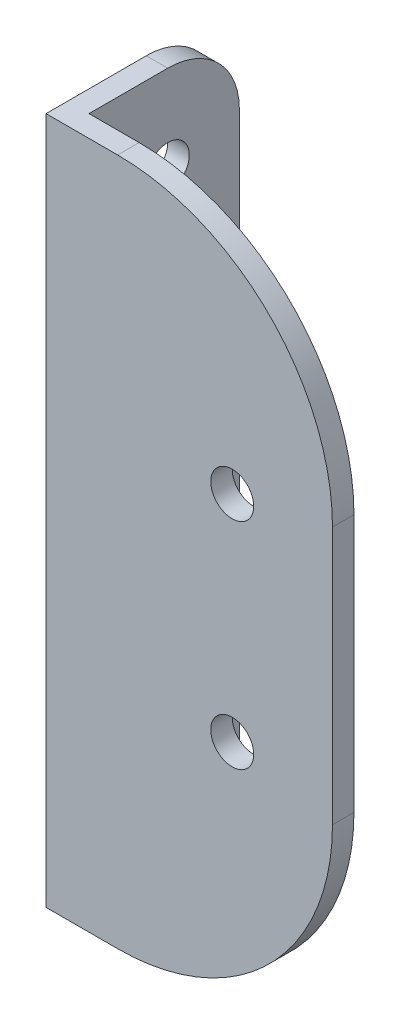
ISO-10303-21;
HEADER;
FILE_DESCRIPTION(('STEP AP214'),'2;1');
FILE_NAME('part.step','',(''),(''),'','','');
FILE_SCHEMA(('AUTOMOTIVE_DESIGN { 1 0 10303 214 1 1 1 1 }'));
ENDSEC;
DATA;
#1=APPLICATION_CONTEXT('core data for automotive mechanical design processes');
#2=APPLICATION_PROTOCOL_DEFINITION('international standard','automotive_design',2000,#1);
#3=PRODUCT_CONTEXT('',#1,'mechanical');
#4=PRODUCT('Part','Part','',(#3));
#5=PRODUCT_RELATED_PRODUCT_CATEGORY('part','',(#4));
#6=PRODUCT_DEFINITION_FORMATION('','',#4);
#7=PRODUCT_DEFINITION_CONTEXT('part definition',#1,'design');
#8=PRODUCT_DEFINITION('design','',#6,#7);
#9=PRODUCT_DEFINITION_SHAPE('','',#8);
#10=(LENGTH_UNIT() NAMED_UNIT(*) SI_UNIT(.MILLI.,.METRE.));
#11=(NAMED_UNIT(*) PLANE_ANGLE_UNIT() SI_UNIT($,.RADIAN.));
#12=(NAMED_UNIT(*) SI_UNIT($,.STERADIAN.) SOLID_ANGLE_UNIT());
#13=UNCERTAINTY_MEASURE_WITH_UNIT(LENGTH_MEASURE(1.E-05),#10,'distance_accuracy_value','');
#14=(GEOMETRIC_REPRESENTATION_CONTEXT(3) GLOBAL_UNCERTAINTY_ASSIGNED_CONTEXT((#13)) GLOBAL_UNIT_ASSIGNED_CONTEXT((#10,
#11,#12)) REPRESENTATION_CONTEXT('',''));
#15=CARTESIAN_POINT('',(0.,0.,0.));
#16=DIRECTION('',(0.,0.,1.));
#17=DIRECTION('',(1.,0.,0.));
#18=AXIS2_PLACEMENT_3D('',#15,#16,#17);
#19=CARTESIAN_POINT('',(0.,48.,0.));
#20=DIRECTION('',(0.,0.,-1.));
#21=DIRECTION('',(-1.,0.,0.));
#22=AXIS2_PLACEMENT_3D('',#19,#20,#21);
#23=PLANE('',#22);
#24=CARTESIAN_POINT('',(13.,16.5,0.));
#25=DIRECTION('',(0.,0.,1.));
#26=DIRECTION('',(1.,0.,0.));
#27=AXIS2_PLACEMENT_3D('',#24,#25,#26);
#28=CIRCLE('',#27,1.5);
#29=CARTESIAN_POINT('',(14.5,16.5,0.));
#30=VERTEX_POINT('',#29);
#31=EDGE_CURVE('E173',#30,#30,#28,.T.);
#32=ORIENTED_EDGE('',*,*,#31,.F.);
#33=EDGE_LOOP('',(#32));
#34=FACE_BOUND('',#33,.T.);
#35=CARTESIAN_POINT('',(13.,31.5,0.));
#36=DIRECTION('',(0.,0.,1.));
#37=DIRECTION('',(1.,0.,0.));
#38=AXIS2_PLACEMENT_3D('',#35,#36,#37);
#39=CIRCLE('',#38,1.5);
#40=CARTESIAN_POINT('',(14.5,31.5,0.));
#41=VERTEX_POINT('',#40);
#42=EDGE_CURVE('E169',#41,#41,#39,.T.);
#43=ORIENTED_EDGE('',*,*,#42,.F.);
#44=EDGE_LOOP('',(#43));
#45=FACE_BOUND('',#44,.T.);
#46=DIRECTION('',(1.,0.,0.));
#47=VECTOR('',#46,1.);
#48=CARTESIAN_POINT('',(0.,0.,0.));
#49=LINE('',#48,#47);
#50=CARTESIAN_POINT('',(0.,0.,0.));
#51=VERTEX_POINT('',#50);
#52=CARTESIAN_POINT('',(5.,0.,0.));
#53=VERTEX_POINT('',#52);
#54=EDGE_CURVE('E147',#51,#53,#49,.T.);
#55=ORIENTED_EDGE('',*,*,#54,.T.);
#56=CARTESIAN_POINT('',(5.,15.,0.));
#57=DIRECTION('',(0.,0.,-1.));
#58=DIRECTION('',(-1.,0.,0.));
#59=AXIS2_PLACEMENT_3D('',#56,#57,#58);
#60=CIRCLE('',#59,15.);
#61=CARTESIAN_POINT('',(20.,15.,0.));
#62=VERTEX_POINT('',#61);
#63=EDGE_CURVE('E42',#53,#62,#60,.F.);
#64=ORIENTED_EDGE('',*,*,#63,.T.);
#65=DIRECTION('',(0.,-1.,0.));
#66=VECTOR('',#65,1.);
#67=CARTESIAN_POINT('',(20.,48.,0.));
#68=LINE('',#67,#66);
#69=CARTESIAN_POINT('',(20.,33.,0.));
#70=VERTEX_POINT('',#69);
#71=EDGE_CURVE('E163',#70,#62,#68,.T.);
#72=ORIENTED_EDGE('',*,*,#71,.F.);
#73=CARTESIAN_POINT('',(5.,33.,0.));
#74=DIRECTION('',(0.,0.,-1.));
#75=DIRECTION('',(-1.,0.,0.));
#76=AXIS2_PLACEMENT_3D('',#73,#74,#75);
#77=CIRCLE('',#76,15.);
#78=CARTESIAN_POINT('',(5.,48.,0.));
#79=VERTEX_POINT('',#78);
#80=EDGE_CURVE('E49',#70,#79,#77,.F.);
#81=ORIENTED_EDGE('',*,*,#80,.T.);
#82=DIRECTION('',(1.,0.,0.));
#83=VECTOR('',#82,1.);
#84=CARTESIAN_POINT('',(0.,48.,0.));
#85=LINE('',#84,#83);
#86=CARTESIAN_POINT('',(0.,48.,0.));
#87=VERTEX_POINT('',#86);
#88=EDGE_CURVE('E124',#87,#79,#85,.T.);
#89=ORIENTED_EDGE('',*,*,#88,.F.);
#90=DIRECTION('',(0.,-1.,0.));
#91=VECTOR('',#90,1.);
#92=CARTESIAN_POINT('',(0.,48.,0.));
#93=LINE('',#92,#91);
#94=EDGE_CURVE('E143',#87,#51,#93,.T.);
#95=ORIENTED_EDGE('',*,*,#94,.T.);
#96=EDGE_LOOP('',(#55,#64,#72,#81,#89,#95));
#97=FACE_BOUND('',#96,.T.);
#98=ADVANCED_FACE('F34',(#34,#45,#97),#23,.F.);
#99=CARTESIAN_POINT('',(20.,48.,-1.5));
#100=DIRECTION('',(-1.,0.,0.));
#101=DIRECTION('',(0.,0.,1.));
#102=AXIS2_PLACEMENT_3D('',#99,#100,#101);
#103=PLANE('',#102);
#104=ORIENTED_EDGE('',*,*,#71,.T.);
#105=DIRECTION('',(0.,0.,-1.));
#106=VECTOR('',#105,1.);
#107=CARTESIAN_POINT('',(20.,15.,-1.5));
#108=LINE('',#107,#106);
#109=CARTESIAN_POINT('',(20.,15.,-1.5));
#110=VERTEX_POINT('',#109);
#111=EDGE_CURVE('E191',#62,#110,#108,.T.);
#112=ORIENTED_EDGE('',*,*,#111,.T.);
#113=DIRECTION('',(0.,-1.,0.));
#114=VECTOR('',#113,1.);
#115=CARTESIAN_POINT('',(20.,48.,-1.5));
#116=LINE('',#115,#114);
#117=CARTESIAN_POINT('',(20.,33.,-1.5));
#118=VERTEX_POINT('',#117);
#119=EDGE_CURVE('E134',#118,#110,#116,.T.);
#120=ORIENTED_EDGE('',*,*,#119,.F.);
#121=DIRECTION('',(0.,0.,-1.));
#122=VECTOR('',#121,1.);
#123=CARTESIAN_POINT('',(20.,33.,-1.5));
#124=LINE('',#123,#122);
#125=EDGE_CURVE('E189',#118,#70,#124,.F.);
#126=ORIENTED_EDGE('',*,*,#125,.T.);
#127=EDGE_LOOP('',(#104,#112,#120,#126));
#128=FACE_BOUND('',#127,.T.);
#129=ADVANCED_FACE('F203',(#128),#103,.F.);
#130=CARTESIAN_POINT('',(1.5,48.,-1.5));
#131=DIRECTION('',(0.,0.,1.));
#132=DIRECTION('',(1.,0.,0.));
#133=AXIS2_PLACEMENT_3D('',#130,#131,#132);
#134=PLANE('',#133);
#135=CARTESIAN_POINT('',(13.,16.5,-1.5));
#136=DIRECTION('',(0.,0.,1.));
#137=DIRECTION('',(1.,0.,0.));
#138=AXIS2_PLACEMENT_3D('',#135,#136,#137);
#139=CIRCLE('',#138,1.5);
#140=CARTESIAN_POINT('',(14.5,16.5,-1.5));
#141=VERTEX_POINT('',#140);
#142=EDGE_CURVE('E170',#141,#141,#139,.T.);
#143=ORIENTED_EDGE('',*,*,#142,.T.);
#144=EDGE_LOOP('',(#143));
#145=FACE_BOUND('',#144,.T.);
#146=CARTESIAN_POINT('',(13.,31.5,-1.5));
#147=DIRECTION('',(0.,0.,1.));
#148=DIRECTION('',(1.,0.,0.));
#149=AXIS2_PLACEMENT_3D('',#146,#147,#148);
#150=CIRCLE('',#149,1.5);
#151=CARTESIAN_POINT('',(14.5,31.5,-1.5));
#152=VERTEX_POINT('',#151);
#153=EDGE_CURVE('E149',#152,#152,#150,.T.);
#154=ORIENTED_EDGE('',*,*,#153,.T.);
#155=EDGE_LOOP('',(#154));
#156=FACE_BOUND('',#155,.T.);
#157=ORIENTED_EDGE('',*,*,#119,.T.);
#158=CARTESIAN_POINT('',(5.,15.,-1.5));
#159=DIRECTION('',(0.,0.,1.));
#160=DIRECTION('',(1.,0.,0.));
#161=AXIS2_PLACEMENT_3D('',#158,#159,#160);
#162=CIRCLE('',#161,15.);
#163=CARTESIAN_POINT('',(5.,0.,-1.5));
#164=VERTEX_POINT('',#163);
#165=EDGE_CURVE('E196',#110,#164,#162,.F.);
#166=ORIENTED_EDGE('',*,*,#165,.T.);
#167=DIRECTION('',(-1.,0.,0.));
#168=VECTOR('',#167,1.);
#169=CARTESIAN_POINT('',(1.5,0.,-1.5));
#170=LINE('',#169,#168);
#171=CARTESIAN_POINT('',(1.5,0.,-1.5));
#172=VERTEX_POINT('',#171);
#173=EDGE_CURVE('E130',#164,#172,#170,.T.);
#174=ORIENTED_EDGE('',*,*,#173,.T.);
#175=DIRECTION('',(0.,-1.,0.));
#176=VECTOR('',#175,1.);
#177=CARTESIAN_POINT('',(1.5,48.,-1.5));
#178=LINE('',#177,#176);
#179=CARTESIAN_POINT('',(1.5,48.,-1.5));
#180=VERTEX_POINT('',#179);
#181=EDGE_CURVE('E127',#180,#172,#178,.T.);
#182=ORIENTED_EDGE('',*,*,#181,.F.);
#183=DIRECTION('',(-1.,0.,0.));
#184=VECTOR('',#183,1.);
#185=CARTESIAN_POINT('',(1.5,48.,-1.5));
#186=LINE('',#185,#184);
#187=CARTESIAN_POINT('',(5.,48.,-1.5));
#188=VERTEX_POINT('',#187);
#189=EDGE_CURVE('E115',#188,#180,#186,.T.);
#190=ORIENTED_EDGE('',*,*,#189,.F.);
#191=CARTESIAN_POINT('',(5.,33.,-1.5));
#192=DIRECTION('',(0.,0.,1.));
#193=DIRECTION('',(1.,0.,0.));
#194=AXIS2_PLACEMENT_3D('',#191,#192,#193);
#195=CIRCLE('',#194,15.);
#196=EDGE_CURVE('E194',#188,#118,#195,.F.);
#197=ORIENTED_EDGE('',*,*,#196,.T.);
#198=EDGE_LOOP('',(#157,#166,#174,#182,#190,#197));
#199=FACE_BOUND('',#198,.T.);
#200=ADVANCED_FACE('F129',(#145,#156,#199),#134,.F.);
#201=CARTESIAN_POINT('',(1.5,48.,-12.));
#202=DIRECTION('',(-1.,0.,0.));
#203=DIRECTION('',(0.,0.,1.));
#204=AXIS2_PLACEMENT_3D('',#201,#202,#203);
#205=PLANE('',#204);
#206=CARTESIAN_POINT('',(1.5,24.,-7.));
#207=DIRECTION('',(-1.,0.,0.));
#208=DIRECTION('',(0.,0.,1.));
#209=AXIS2_PLACEMENT_3D('',#206,#207,#208);
#210=CIRCLE('',#209,3.);
#211=CARTESIAN_POINT('',(1.5,24.,-4.));
#212=VERTEX_POINT('',#211);
#213=EDGE_CURVE('E235',#212,#212,#210,.F.);
#214=ORIENTED_EDGE('',*,*,#213,.F.);
#215=EDGE_LOOP('',(#214));
#216=FACE_BOUND('',#215,.T.);
#217=CARTESIAN_POINT('',(1.5,6.00000000000001,-7.00000000000001));
#218=DIRECTION('',(-1.,0.,0.));
#219=DIRECTION('',(0.,0.,1.));
#220=AXIS2_PLACEMENT_3D('',#217,#218,#219);
#221=CIRCLE('',#220,1.5);
#222=CARTESIAN_POINT('',(1.5,6.00000000000001,-5.50000000000001));
#223=VERTEX_POINT('',#222);
#224=EDGE_CURVE('E238',#223,#223,#221,.F.);
#225=ORIENTED_EDGE('',*,*,#224,.F.);
#226=EDGE_LOOP('',(#225));
#227=FACE_BOUND('',#226,.T.);
#228=CARTESIAN_POINT('',(1.5,42.,-7.));
#229=DIRECTION('',(-1.,0.,0.));
#230=DIRECTION('',(0.,0.,1.));
#231=AXIS2_PLACEMENT_3D('',#228,#229,#230);
#232=CIRCLE('',#231,1.5);
#233=CARTESIAN_POINT('',(1.5,42.,-5.5));
#234=VERTEX_POINT('',#233);
#235=EDGE_CURVE('E229',#234,#234,#232,.F.);
#236=ORIENTED_EDGE('',*,*,#235,.F.);
#237=EDGE_LOOP('',(#236));
#238=FACE_BOUND('',#237,.T.);
#239=DIRECTION('',(0.,0.,-1.));
#240=VECTOR('',#239,1.);
#241=CARTESIAN_POINT('',(1.5,0.,-12.));
#242=LINE('',#241,#240);
#243=CARTESIAN_POINT('',(1.5,0.,-7.));
#244=VERTEX_POINT('',#243);
#245=EDGE_CURVE('E151',#172,#244,#242,.T.);
#246=ORIENTED_EDGE('',*,*,#245,.T.);
#247=CARTESIAN_POINT('',(1.5,5.,-7.));
#248=DIRECTION('',(-1.,0.,0.));
#249=DIRECTION('',(0.,0.,1.));
#250=AXIS2_PLACEMENT_3D('',#247,#248,#249);
#251=CIRCLE('',#250,5.);
#252=CARTESIAN_POINT('',(1.5,5.,-12.));
#253=VERTEX_POINT('',#252);
#254=EDGE_CURVE('E185',#244,#253,#251,.F.);
#255=ORIENTED_EDGE('',*,*,#254,.T.);
#256=DIRECTION('',(0.,-1.,0.));
#257=VECTOR('',#256,1.);
#258=CARTESIAN_POINT('',(1.5,48.,-12.));
#259=LINE('',#258,#257);
#260=CARTESIAN_POINT('',(1.5,43.,-12.));
#261=VERTEX_POINT('',#260);
#262=EDGE_CURVE('E135',#261,#253,#259,.T.);
#263=ORIENTED_EDGE('',*,*,#262,.F.);
#264=CARTESIAN_POINT('',(1.5,43.,-7.));
#265=DIRECTION('',(-1.,0.,0.));
#266=DIRECTION('',(0.,0.,1.));
#267=AXIS2_PLACEMENT_3D('',#264,#265,#266);
#268=CIRCLE('',#267,5.);
#269=CARTESIAN_POINT('',(1.5,48.,-7.));
#270=VERTEX_POINT('',#269);
#271=EDGE_CURVE('E140',#261,#270,#268,.F.);
#272=ORIENTED_EDGE('',*,*,#271,.T.);
#273=DIRECTION('',(0.,0.,-1.));
#274=VECTOR('',#273,1.);
#275=CARTESIAN_POINT('',(1.5,48.,-12.));
#276=LINE('',#275,#274);
#277=EDGE_CURVE('E120',#180,#270,#276,.T.);
#278=ORIENTED_EDGE('',*,*,#277,.F.);
#279=ORIENTED_EDGE('',*,*,#181,.T.);
#280=EDGE_LOOP('',(#246,#255,#263,#272,#278,#279));
#281=FACE_BOUND('',#280,.T.);
#282=ADVANCED_FACE('F137',(#216,#227,#238,#281),#205,.F.);
#283=CARTESIAN_POINT('',(0.,48.,-12.));
#284=DIRECTION('',(0.,0.,1.));
#285=DIRECTION('',(1.,0.,0.));
#286=AXIS2_PLACEMENT_3D('',#283,#284,#285);
#287=PLANE('',#286);
#288=ORIENTED_EDGE('',*,*,#262,.T.);
#289=DIRECTION('',(-1.,0.,0.));
#290=VECTOR('',#289,1.);
#291=CARTESIAN_POINT('',(0.,5.,-12.));
#292=LINE('',#291,#290);
#293=CARTESIAN_POINT('',(0.,5.,-12.));
#294=VERTEX_POINT('',#293);
#295=EDGE_CURVE('E175',#253,#294,#292,.T.);
#296=ORIENTED_EDGE('',*,*,#295,.T.);
#297=DIRECTION('',(0.,-1.,0.));
#298=VECTOR('',#297,1.);
#299=CARTESIAN_POINT('',(0.,48.,-12.));
#300=LINE('',#299,#298);
#301=CARTESIAN_POINT('',(0.,43.,-12.));
#302=VERTEX_POINT('',#301);
#303=EDGE_CURVE('E157',#302,#294,#300,.T.);
#304=ORIENTED_EDGE('',*,*,#303,.F.);
#305=DIRECTION('',(-1.,0.,0.));
#306=VECTOR('',#305,1.);
#307=CARTESIAN_POINT('',(0.,43.,-12.));
#308=LINE('',#307,#306);
#309=EDGE_CURVE('E166',#302,#261,#308,.F.);
#310=ORIENTED_EDGE('',*,*,#309,.T.);
#311=EDGE_LOOP('',(#288,#296,#304,#310));
#312=FACE_BOUND('',#311,.T.);
#313=ADVANCED_FACE('F216',(#312),#287,.F.);
#314=CARTESIAN_POINT('',(0.,48.,0.));
#315=DIRECTION('',(1.,0.,0.));
#316=DIRECTION('',(0.,0.,-1.));
#317=AXIS2_PLACEMENT_3D('',#314,#315,#316);
#318=PLANE('',#317);
#319=CARTESIAN_POINT('',(0.,24.,-7.));
#320=DIRECTION('',(1.,0.,0.));
#321=DIRECTION('',(0.,0.,-1.));
#322=AXIS2_PLACEMENT_3D('',#319,#320,#321);
#323=CIRCLE('',#322,3.);
#324=CARTESIAN_POINT('',(0.,24.,-10.));
#325=VERTEX_POINT('',#324);
#326=EDGE_CURVE('E241',#325,#325,#323,.T.);
#327=ORIENTED_EDGE('',*,*,#326,.T.);
#328=EDGE_LOOP('',(#327));
#329=FACE_BOUND('',#328,.T.);
#330=CARTESIAN_POINT('',(0.,6.00000000000001,-7.00000000000001));
#331=DIRECTION('',(1.,0.,0.));
#332=DIRECTION('',(0.,0.,-1.));
#333=AXIS2_PLACEMENT_3D('',#330,#331,#332);
#334=CIRCLE('',#333,1.5);
#335=CARTESIAN_POINT('',(0.,6.00000000000001,-8.5));
#336=VERTEX_POINT('',#335);
#337=EDGE_CURVE('E242',#336,#336,#334,.T.);
#338=ORIENTED_EDGE('',*,*,#337,.T.);
#339=EDGE_LOOP('',(#338));
#340=FACE_BOUND('',#339,.T.);
#341=CARTESIAN_POINT('',(0.,42.,-7.));
#342=DIRECTION('',(1.,0.,0.));
#343=DIRECTION('',(0.,0.,-1.));
#344=AXIS2_PLACEMENT_3D('',#341,#342,#343);
#345=CIRCLE('',#344,1.5);
#346=CARTESIAN_POINT('',(0.,42.,-8.5));
#347=VERTEX_POINT('',#346);
#348=EDGE_CURVE('E232',#347,#347,#345,.T.);
#349=ORIENTED_EDGE('',*,*,#348,.T.);
#350=EDGE_LOOP('',(#349));
#351=FACE_BOUND('',#350,.T.);
#352=ORIENTED_EDGE('',*,*,#303,.T.);
#353=CARTESIAN_POINT('',(0.,5.,-7.));
#354=DIRECTION('',(1.,0.,0.));
#355=DIRECTION('',(0.,0.,-1.));
#356=AXIS2_PLACEMENT_3D('',#353,#354,#355);
#357=CIRCLE('',#356,5.);
#358=CARTESIAN_POINT('',(0.,0.,-7.));
#359=VERTEX_POINT('',#358);
#360=EDGE_CURVE('E180',#294,#359,#357,.F.);
#361=ORIENTED_EDGE('',*,*,#360,.T.);
#362=DIRECTION('',(0.,0.,1.));
#363=VECTOR('',#362,1.);
#364=CARTESIAN_POINT('',(0.,0.,0.));
#365=LINE('',#364,#363);
#366=EDGE_CURVE('E153',#359,#51,#365,.T.);
#367=ORIENTED_EDGE('',*,*,#366,.T.);
#368=ORIENTED_EDGE('',*,*,#94,.F.);
#369=DIRECTION('',(0.,0.,1.));
#370=VECTOR('',#369,1.);
#371=CARTESIAN_POINT('',(0.,48.,0.));
#372=LINE('',#371,#370);
#373=CARTESIAN_POINT('',(0.,48.,-7.));
#374=VERTEX_POINT('',#373);
#375=EDGE_CURVE('E141',#374,#87,#372,.T.);
#376=ORIENTED_EDGE('',*,*,#375,.F.);
#377=CARTESIAN_POINT('',(0.,43.,-7.));
#378=DIRECTION('',(1.,0.,0.));
#379=DIRECTION('',(0.,0.,-1.));
#380=AXIS2_PLACEMENT_3D('',#377,#378,#379);
#381=CIRCLE('',#380,5.);
#382=EDGE_CURVE('E178',#374,#302,#381,.F.);
#383=ORIENTED_EDGE('',*,*,#382,.T.);
#384=EDGE_LOOP('',(#352,#361,#367,#368,#376,#383));
#385=FACE_BOUND('',#384,.T.);
#386=ADVANCED_FACE('F219',(#329,#340,#351,#385),#318,.F.);
#387=CARTESIAN_POINT('',(0.,48.,0.));
#388=DIRECTION('',(0.,-1.,0.));
#389=DIRECTION('',(0.,0.,-1.));
#390=AXIS2_PLACEMENT_3D('',#387,#388,#389);
#391=PLANE('',#390);
#392=ORIENTED_EDGE('',*,*,#88,.T.);
#393=DIRECTION('',(0.,0.,-1.));
#394=VECTOR('',#393,1.);
#395=CARTESIAN_POINT('',(5.,48.,0.));
#396=LINE('',#395,#394);
#397=EDGE_CURVE('E11',#79,#188,#396,.T.);
#398=ORIENTED_EDGE('',*,*,#397,.T.);
#399=ORIENTED_EDGE('',*,*,#189,.T.);
#400=ORIENTED_EDGE('',*,*,#277,.T.);
#401=DIRECTION('',(-1.,0.,0.));
#402=VECTOR('',#401,1.);
#403=CARTESIAN_POINT('',(0.,48.,-7.));
#404=LINE('',#403,#402);
#405=EDGE_CURVE('E187',#270,#374,#404,.T.);
#406=ORIENTED_EDGE('',*,*,#405,.T.);
#407=ORIENTED_EDGE('',*,*,#375,.T.);
#408=EDGE_LOOP('',(#392,#398,#399,#400,#406,#407));
#409=FACE_BOUND('',#408,.T.);
#410=ADVANCED_FACE('F117',(#409),#391,.F.);
#411=CARTESIAN_POINT('',(0.,0.,0.));
#412=DIRECTION('',(0.,-1.,0.));
#413=DIRECTION('',(0.,0.,-1.));
#414=AXIS2_PLACEMENT_3D('',#411,#412,#413);
#415=PLANE('',#414);
#416=ORIENTED_EDGE('',*,*,#173,.F.);
#417=DIRECTION('',(0.,0.,-1.));
#418=VECTOR('',#417,1.);
#419=CARTESIAN_POINT('',(5.,0.,0.));
#420=LINE('',#419,#418);
#421=EDGE_CURVE('E57',#164,#53,#420,.F.);
#422=ORIENTED_EDGE('',*,*,#421,.T.);
#423=ORIENTED_EDGE('',*,*,#54,.F.);
#424=ORIENTED_EDGE('',*,*,#366,.F.);
#425=DIRECTION('',(-1.,0.,0.));
#426=VECTOR('',#425,1.);
#427=CARTESIAN_POINT('',(1.5,0.,-7.));
#428=LINE('',#427,#426);
#429=EDGE_CURVE('E182',#359,#244,#428,.F.);
#430=ORIENTED_EDGE('',*,*,#429,.T.);
#431=ORIENTED_EDGE('',*,*,#245,.F.);
#432=EDGE_LOOP('',(#416,#422,#423,#424,#430,#431));
#433=FACE_BOUND('',#432,.T.);
#434=ADVANCED_FACE('F207',(#433),#415,.T.);
#435=CARTESIAN_POINT('',(13.,31.5,-12.));
#436=DIRECTION('',(0.,0.,1.));
#437=DIRECTION('',(1.,0.,0.));
#438=AXIS2_PLACEMENT_3D('',#435,#436,#437);
#439=CYLINDRICAL_SURFACE('',#438,1.5);
#440=ORIENTED_EDGE('',*,*,#42,.T.);
#441=EDGE_LOOP('',(#440));
#442=FACE_BOUND('',#441,.T.);
#443=ORIENTED_EDGE('',*,*,#153,.F.);
#444=EDGE_LOOP('',(#443));
#445=FACE_BOUND('',#444,.T.);
#446=ADVANCED_FACE('F275',(#442,#445),#439,.F.);
#447=CARTESIAN_POINT('',(13.,16.5,-12.));
#448=DIRECTION('',(0.,0.,1.));
#449=DIRECTION('',(1.,0.,0.));
#450=AXIS2_PLACEMENT_3D('',#447,#448,#449);
#451=CYLINDRICAL_SURFACE('',#450,1.5);
#452=ORIENTED_EDGE('',*,*,#31,.T.);
#453=EDGE_LOOP('',(#452));
#454=FACE_BOUND('',#453,.T.);
#455=ORIENTED_EDGE('',*,*,#142,.F.);
#456=EDGE_LOOP('',(#455));
#457=FACE_BOUND('',#456,.T.);
#458=ADVANCED_FACE('F266',(#454,#457),#451,.F.);
#459=CARTESIAN_POINT('',(20.,42.,-7.));
#460=DIRECTION('',(-1.,0.,0.));
#461=DIRECTION('',(0.,0.,1.));
#462=AXIS2_PLACEMENT_3D('',#459,#460,#461);
#463=CYLINDRICAL_SURFACE('',#462,1.5);
#464=ORIENTED_EDGE('',*,*,#348,.F.);
#465=EDGE_LOOP('',(#464));
#466=FACE_BOUND('',#465,.T.);
#467=ORIENTED_EDGE('',*,*,#235,.T.);
#468=EDGE_LOOP('',(#467));
#469=FACE_BOUND('',#468,.T.);
#470=ADVANCED_FACE('F264',(#466,#469),#463,.F.);
#471=CARTESIAN_POINT('',(20.,6.00000000000001,-7.00000000000001));
#472=DIRECTION('',(-1.,0.,0.));
#473=DIRECTION('',(0.,0.,1.));
#474=AXIS2_PLACEMENT_3D('',#471,#472,#473);
#475=CYLINDRICAL_SURFACE('',#474,1.5);
#476=ORIENTED_EDGE('',*,*,#337,.F.);
#477=EDGE_LOOP('',(#476));
#478=FACE_BOUND('',#477,.T.);
#479=ORIENTED_EDGE('',*,*,#224,.T.);
#480=EDGE_LOOP('',(#479));
#481=FACE_BOUND('',#480,.T.);
#482=ADVANCED_FACE('F253',(#478,#481),#475,.F.);
#483=CARTESIAN_POINT('',(20.,24.,-7.));
#484=DIRECTION('',(-1.,0.,0.));
#485=DIRECTION('',(0.,0.,1.));
#486=AXIS2_PLACEMENT_3D('',#483,#484,#485);
#487=CYLINDRICAL_SURFACE('',#486,3.);
#488=ORIENTED_EDGE('',*,*,#326,.F.);
#489=EDGE_LOOP('',(#488));
#490=FACE_BOUND('',#489,.T.);
#491=ORIENTED_EDGE('',*,*,#213,.T.);
#492=EDGE_LOOP('',(#491));
#493=FACE_BOUND('',#492,.T.);
#494=ADVANCED_FACE('F250',(#490,#493),#487,.F.);
#495=CARTESIAN_POINT('',(0.,5.,-7.));
#496=DIRECTION('',(1.,0.,0.));
#497=DIRECTION('',(0.,0.,-1.));
#498=AXIS2_PLACEMENT_3D('',#495,#496,#497);
#499=CYLINDRICAL_SURFACE('',#498,5.);
#500=ORIENTED_EDGE('',*,*,#254,.F.);
#501=ORIENTED_EDGE('',*,*,#429,.F.);
#502=ORIENTED_EDGE('',*,*,#360,.F.);
#503=ORIENTED_EDGE('',*,*,#295,.F.);
#504=EDGE_LOOP('',(#500,#501,#502,#503));
#505=FACE_BOUND('',#504,.T.);
#506=ADVANCED_FACE('F213',(#505),#499,.T.);
#507=CARTESIAN_POINT('',(0.,43.,-7.));
#508=DIRECTION('',(-1.,0.,0.));
#509=DIRECTION('',(0.,0.,1.));
#510=AXIS2_PLACEMENT_3D('',#507,#508,#509);
#511=CYLINDRICAL_SURFACE('',#510,5.);
#512=ORIENTED_EDGE('',*,*,#271,.F.);
#513=ORIENTED_EDGE('',*,*,#309,.F.);
#514=ORIENTED_EDGE('',*,*,#382,.F.);
#515=ORIENTED_EDGE('',*,*,#405,.F.);
#516=EDGE_LOOP('',(#512,#513,#514,#515));
#517=FACE_BOUND('',#516,.T.);
#518=ADVANCED_FACE('F223',(#517),#511,.T.);
#519=CARTESIAN_POINT('',(5.,15.,-1.5));
#520=DIRECTION('',(0.,0.,1.));
#521=DIRECTION('',(1.,0.,0.));
#522=AXIS2_PLACEMENT_3D('',#519,#520,#521);
#523=CYLINDRICAL_SURFACE('',#522,15.);
#524=ORIENTED_EDGE('',*,*,#63,.F.);
#525=ORIENTED_EDGE('',*,*,#421,.F.);
#526=ORIENTED_EDGE('',*,*,#165,.F.);
#527=ORIENTED_EDGE('',*,*,#111,.F.);
#528=EDGE_LOOP('',(#524,#525,#526,#527));
#529=FACE_BOUND('',#528,.T.);
#530=ADVANCED_FACE('F206',(#529),#523,.T.);
#531=CARTESIAN_POINT('',(5.,33.,0.));
#532=DIRECTION('',(0.,0.,-1.));
#533=DIRECTION('',(-1.,0.,0.));
#534=AXIS2_PLACEMENT_3D('',#531,#532,#533);
#535=CYLINDRICAL_SURFACE('',#534,15.);
#536=ORIENTED_EDGE('',*,*,#80,.F.);
#537=ORIENTED_EDGE('',*,*,#125,.F.);
#538=ORIENTED_EDGE('',*,*,#196,.F.);
#539=ORIENTED_EDGE('',*,*,#397,.F.);
#540=EDGE_LOOP('',(#536,#537,#538,#539));
#541=FACE_BOUND('',#540,.T.);
#542=ADVANCED_FACE('F36',(#541),#535,.T.);
#543=CLOSED_SHELL('',(#98,#129,#200,#282,#313,#386,#410,#434,#446,#458,#470,#482,#494,#506,#518,
#530,#542));
#544=MANIFOLD_SOLID_BREP('B2',#543);
#545=ADVANCED_BREP_SHAPE_REPRESENTATION('',(#18,#544),#14);
#546=SHAPE_DEFINITION_REPRESENTATION(#9,#545);
ENDSEC;
END-ISO-10303-21;
